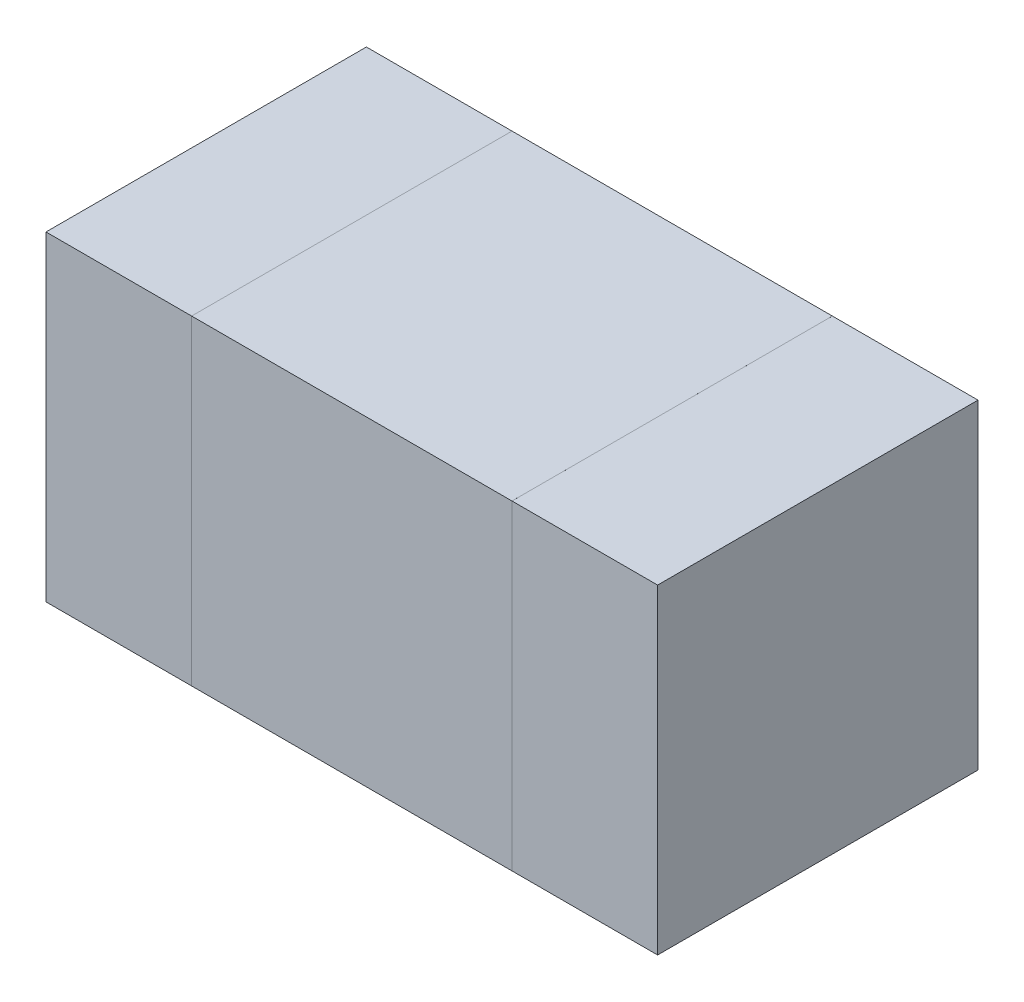
ISO-10303-21;
HEADER;
FILE_DESCRIPTION(('STEP AP214'),'2;1');
FILE_NAME('part.step','',(''),(''),'','','');
FILE_SCHEMA(('AUTOMOTIVE_DESIGN { 1 0 10303 214 1 1 1 1 }'));
ENDSEC;
DATA;
#1=APPLICATION_CONTEXT('core data for automotive mechanical design processes');
#2=APPLICATION_PROTOCOL_DEFINITION('international standard','automotive_design',2000,#1);
#3=PRODUCT_CONTEXT('',#1,'mechanical');
#4=PRODUCT('Part','Part','',(#3));
#5=PRODUCT_RELATED_PRODUCT_CATEGORY('part','',(#4));
#6=PRODUCT_DEFINITION_FORMATION('','',#4);
#7=PRODUCT_DEFINITION_CONTEXT('part definition',#1,'design');
#8=PRODUCT_DEFINITION('design','',#6,#7);
#9=PRODUCT_DEFINITION_SHAPE('','',#8);
#10=(LENGTH_UNIT() NAMED_UNIT(*) SI_UNIT(.MILLI.,.METRE.));
#11=(NAMED_UNIT(*) PLANE_ANGLE_UNIT() SI_UNIT($,.RADIAN.));
#12=(NAMED_UNIT(*) SI_UNIT($,.STERADIAN.) SOLID_ANGLE_UNIT());
#13=UNCERTAINTY_MEASURE_WITH_UNIT(LENGTH_MEASURE(1.E-05),#10,'distance_accuracy_value','');
#14=(GEOMETRIC_REPRESENTATION_CONTEXT(3) GLOBAL_UNCERTAINTY_ASSIGNED_CONTEXT((#13)) GLOBAL_UNIT_ASSIGNED_CONTEXT((#10,
#11,#12)) REPRESENTATION_CONTEXT('',''));
#15=CARTESIAN_POINT('',(0.,0.,0.));
#16=DIRECTION('',(0.,0.,1.));
#17=DIRECTION('',(1.,0.,0.));
#18=AXIS2_PLACEMENT_3D('',#15,#16,#17);
#19=CARTESIAN_POINT('',(3.810002799805,0.285000471953,0.32999934));
#20=DIRECTION('',(0.,0.,-1.));
#21=DIRECTION('',(0.,-1.,0.));
#22=AXIS2_PLACEMENT_3D('',#19,#20,#21);
#23=PLANE('',#22);
#24=DIRECTION('',(0.,1.,0.));
#25=VECTOR('',#24,1.);
#26=CARTESIAN_POINT('',(3.810002799805,0.285000471953,0.32999934));
#27=LINE('',#26,#25);
#28=CARTESIAN_POINT('',(3.810002799805,0.285000471953,0.32999934));
#29=VERTEX_POINT('',#28);
#30=CARTESIAN_POINT('',(3.810002799805,0.615002351953,0.32999934));
#31=VERTEX_POINT('',#30);
#32=EDGE_CURVE('P0_E84',#29,#31,#27,.T.);
#33=ORIENTED_EDGE('',*,*,#32,.T.);
#34=DIRECTION('',(-1.,0.,0.));
#35=VECTOR('',#34,1.);
#36=CARTESIAN_POINT('',(3.810002799805,0.615002351953,0.32999934));
#37=LINE('',#36,#35);
#38=CARTESIAN_POINT('',(3.660000559805,0.615002351953,0.32999934));
#39=VERTEX_POINT('',#38);
#40=EDGE_CURVE('P0_E82',#31,#39,#37,.T.);
#41=ORIENTED_EDGE('',*,*,#40,.T.);
#42=DIRECTION('',(0.,-1.,0.));
#43=VECTOR('',#42,1.);
#44=CARTESIAN_POINT('',(3.660000559805,0.615002351953,0.32999934));
#45=LINE('',#44,#43);
#46=CARTESIAN_POINT('',(3.660000559805,0.285000471953,0.32999934));
#47=VERTEX_POINT('',#46);
#48=EDGE_CURVE('P0_E72',#39,#47,#45,.T.);
#49=ORIENTED_EDGE('',*,*,#48,.T.);
#50=DIRECTION('',(1.,0.,0.));
#51=VECTOR('',#50,1.);
#52=CARTESIAN_POINT('',(3.660000559805,0.285000471953,0.32999934));
#53=LINE('',#52,#51);
#54=EDGE_CURVE('P0_E11',#47,#29,#53,.T.);
#55=ORIENTED_EDGE('',*,*,#54,.T.);
#56=EDGE_LOOP('',(#33,#41,#49,#55));
#57=FACE_BOUND('',#56,.T.);
#58=ADVANCED_FACE('P0_F17',(#57),#23,.F.);
#59=CARTESIAN_POINT('',(3.810002799805,0.285000471953,0.));
#60=DIRECTION('',(0.,0.,-1.));
#61=DIRECTION('',(0.,-1.,0.));
#62=AXIS2_PLACEMENT_3D('',#59,#60,#61);
#63=PLANE('',#62);
#64=DIRECTION('',(1.,0.,0.));
#65=VECTOR('',#64,1.);
#66=CARTESIAN_POINT('',(3.660000559805,0.285000471953,0.));
#67=LINE('',#66,#65);
#68=CARTESIAN_POINT('',(3.660000559805,0.285000471953,0.));
#69=VERTEX_POINT('',#68);
#70=CARTESIAN_POINT('',(3.810002799805,0.285000471953,0.));
#71=VERTEX_POINT('',#70);
#72=EDGE_CURVE('P0_E27',#69,#71,#67,.T.);
#73=ORIENTED_EDGE('',*,*,#72,.F.);
#74=DIRECTION('',(0.,-1.,0.));
#75=VECTOR('',#74,1.);
#76=CARTESIAN_POINT('',(3.660000559805,0.615002351953,0.));
#77=LINE('',#76,#75);
#78=CARTESIAN_POINT('',(3.660000559805,0.615002351953,0.));
#79=VERTEX_POINT('',#78);
#80=EDGE_CURVE('P0_E65',#79,#69,#77,.T.);
#81=ORIENTED_EDGE('',*,*,#80,.F.);
#82=DIRECTION('',(-1.,0.,0.));
#83=VECTOR('',#82,1.);
#84=CARTESIAN_POINT('',(3.810002799805,0.615002351953,0.));
#85=LINE('',#84,#83);
#86=CARTESIAN_POINT('',(3.810002799805,0.615002351953,0.));
#87=VERTEX_POINT('',#86);
#88=EDGE_CURVE('P0_E91',#87,#79,#85,.T.);
#89=ORIENTED_EDGE('',*,*,#88,.F.);
#90=DIRECTION('',(0.,1.,0.));
#91=VECTOR('',#90,1.);
#92=CARTESIAN_POINT('',(3.810002799805,0.285000471953,0.));
#93=LINE('',#92,#91);
#94=EDGE_CURVE('P0_E162',#71,#87,#93,.T.);
#95=ORIENTED_EDGE('',*,*,#94,.F.);
#96=EDGE_LOOP('',(#73,#81,#89,#95));
#97=FACE_BOUND('',#96,.T.);
#98=ADVANCED_FACE('P0_F132',(#97),#63,.T.);
#99=CARTESIAN_POINT('',(3.660000559805,0.285000471953,0.));
#100=DIRECTION('',(0.,1.,0.));
#101=DIRECTION('',(1.,0.,0.));
#102=AXIS2_PLACEMENT_3D('',#99,#100,#101);
#103=PLANE('',#102);
#104=ORIENTED_EDGE('',*,*,#72,.T.);
#105=DIRECTION('',(0.,0.,1.));
#106=VECTOR('',#105,1.);
#107=CARTESIAN_POINT('',(3.810002799805,0.285000471953,0.));
#108=LINE('',#107,#106);
#109=EDGE_CURVE('P0_E96',#71,#29,#108,.T.);
#110=ORIENTED_EDGE('',*,*,#109,.T.);
#111=ORIENTED_EDGE('',*,*,#54,.F.);
#112=DIRECTION('',(0.,0.,1.));
#113=VECTOR('',#112,1.);
#114=CARTESIAN_POINT('',(3.660000559805,0.285000471953,0.));
#115=LINE('',#114,#113);
#116=EDGE_CURVE('P0_E20',#69,#47,#115,.T.);
#117=ORIENTED_EDGE('',*,*,#116,.F.);
#118=EDGE_LOOP('',(#104,#110,#111,#117));
#119=FACE_BOUND('',#118,.T.);
#120=ADVANCED_FACE('P0_F125',(#119),#103,.F.);
#121=CARTESIAN_POINT('',(3.660000559805,0.615002351953,0.));
#122=DIRECTION('',(1.,0.,0.));
#123=DIRECTION('',(0.,1.,0.));
#124=AXIS2_PLACEMENT_3D('',#121,#122,#123);
#125=PLANE('',#124);
#126=ORIENTED_EDGE('',*,*,#80,.T.);
#127=ORIENTED_EDGE('',*,*,#116,.T.);
#128=ORIENTED_EDGE('',*,*,#48,.F.);
#129=DIRECTION('',(0.,0.,1.));
#130=VECTOR('',#129,1.);
#131=CARTESIAN_POINT('',(3.660000559805,0.615002351953,0.));
#132=LINE('',#131,#130);
#133=EDGE_CURVE('P0_E76',#79,#39,#132,.T.);
#134=ORIENTED_EDGE('',*,*,#133,.F.);
#135=EDGE_LOOP('',(#126,#127,#128,#134));
#136=FACE_BOUND('',#135,.T.);
#137=ADVANCED_FACE('P0_F74',(#136),#125,.F.);
#138=CARTESIAN_POINT('',(3.810002799805,0.615002351953,0.));
#139=DIRECTION('',(0.,-1.,0.));
#140=DIRECTION('',(0.,0.,-1.));
#141=AXIS2_PLACEMENT_3D('',#138,#139,#140);
#142=PLANE('',#141);
#143=ORIENTED_EDGE('',*,*,#88,.T.);
#144=ORIENTED_EDGE('',*,*,#133,.T.);
#145=ORIENTED_EDGE('',*,*,#40,.F.);
#146=DIRECTION('',(0.,0.,1.));
#147=VECTOR('',#146,1.);
#148=CARTESIAN_POINT('',(3.810002799805,0.615002351953,0.));
#149=LINE('',#148,#147);
#150=EDGE_CURVE('P0_E171',#87,#31,#149,.T.);
#151=ORIENTED_EDGE('',*,*,#150,.F.);
#152=EDGE_LOOP('',(#143,#144,#145,#151));
#153=FACE_BOUND('',#152,.T.);
#154=ADVANCED_FACE('P0_F90',(#153),#142,.F.);
#155=CARTESIAN_POINT('',(3.810002799805,0.285000471953,0.));
#156=DIRECTION('',(-1.,0.,0.));
#157=DIRECTION('',(0.,0.,1.));
#158=AXIS2_PLACEMENT_3D('',#155,#156,#157);
#159=PLANE('',#158);
#160=ORIENTED_EDGE('',*,*,#94,.T.);
#161=ORIENTED_EDGE('',*,*,#150,.T.);
#162=ORIENTED_EDGE('',*,*,#32,.F.);
#163=ORIENTED_EDGE('',*,*,#109,.F.);
#164=EDGE_LOOP('',(#160,#161,#162,#163));
#165=FACE_BOUND('',#164,.T.);
#166=ADVANCED_FACE('P0_F106',(#165),#159,.F.);
#167=CLOSED_SHELL('',(#58,#98,#120,#137,#154,#166));
#168=MANIFOLD_SOLID_BREP('P0_B1',#167);
#169=CARTESIAN_POINT('',(4.289998527344,0.285000471953,0.32999934));
#170=DIRECTION('',(0.,0.,-1.));
#171=DIRECTION('',(0.,-1.,0.));
#172=AXIS2_PLACEMENT_3D('',#169,#170,#171);
#173=PLANE('',#172);
#174=DIRECTION('',(0.,1.,0.));
#175=VECTOR('',#174,1.);
#176=CARTESIAN_POINT('',(4.289998527344,0.285000471953,0.32999934));
#177=LINE('',#176,#175);
#178=CARTESIAN_POINT('',(4.289998527344,0.285000471953,0.32999934));
#179=VERTEX_POINT('',#178);
#180=CARTESIAN_POINT('',(4.289998527344,0.615002351953,0.32999934));
#181=VERTEX_POINT('',#180);
#182=EDGE_CURVE('P1_E80',#179,#181,#177,.T.);
#183=ORIENTED_EDGE('',*,*,#182,.T.);
#184=DIRECTION('',(-1.,0.,0.));
#185=VECTOR('',#184,1.);
#186=CARTESIAN_POINT('',(4.289998527344,0.615002351953,0.32999934));
#187=LINE('',#186,#185);
#188=CARTESIAN_POINT('',(4.139996287344,0.615002351953,0.32999934));
#189=VERTEX_POINT('',#188);
#190=EDGE_CURVE('P1_E78',#181,#189,#187,.T.);
#191=ORIENTED_EDGE('',*,*,#190,.T.);
#192=DIRECTION('',(0.,-1.,0.));
#193=VECTOR('',#192,1.);
#194=CARTESIAN_POINT('',(4.139996287344,0.615002351953,0.32999934));
#195=LINE('',#194,#193);
#196=CARTESIAN_POINT('',(4.139996287344,0.285000471953,0.32999934));
#197=VERTEX_POINT('',#196);
#198=EDGE_CURVE('P1_E66',#189,#197,#195,.T.);
#199=ORIENTED_EDGE('',*,*,#198,.T.);
#200=DIRECTION('',(1.,0.,0.));
#201=VECTOR('',#200,1.);
#202=CARTESIAN_POINT('',(4.139996287344,0.285000471953,0.32999934));
#203=LINE('',#202,#201);
#204=EDGE_CURVE('P1_E11',#197,#179,#203,.T.);
#205=ORIENTED_EDGE('',*,*,#204,.T.);
#206=EDGE_LOOP('',(#183,#191,#199,#205));
#207=FACE_BOUND('',#206,.T.);
#208=ADVANCED_FACE('P1_F17',(#207),#173,.F.);
#209=CARTESIAN_POINT('',(4.289998527344,0.285000471953,0.));
#210=DIRECTION('',(0.,0.,-1.));
#211=DIRECTION('',(0.,-1.,0.));
#212=AXIS2_PLACEMENT_3D('',#209,#210,#211);
#213=PLANE('',#212);
#214=DIRECTION('',(1.,0.,0.));
#215=VECTOR('',#214,1.);
#216=CARTESIAN_POINT('',(4.139996287344,0.285000471953,0.));
#217=LINE('',#216,#215);
#218=CARTESIAN_POINT('',(4.139996287344,0.285000471953,0.));
#219=VERTEX_POINT('',#218);
#220=CARTESIAN_POINT('',(4.289998527344,0.285000471953,0.));
#221=VERTEX_POINT('',#220);
#222=EDGE_CURVE('P1_E27',#219,#221,#217,.T.);
#223=ORIENTED_EDGE('',*,*,#222,.F.);
#224=DIRECTION('',(0.,-1.,0.));
#225=VECTOR('',#224,1.);
#226=CARTESIAN_POINT('',(4.139996287344,0.615002351953,0.));
#227=LINE('',#226,#225);
#228=CARTESIAN_POINT('',(4.139996287344,0.615002351953,0.));
#229=VERTEX_POINT('',#228);
#230=EDGE_CURVE('P1_E85',#229,#219,#227,.T.);
#231=ORIENTED_EDGE('',*,*,#230,.F.);
#232=DIRECTION('',(-1.,0.,0.));
#233=VECTOR('',#232,1.);
#234=CARTESIAN_POINT('',(4.289998527344,0.615002351953,0.));
#235=LINE('',#234,#233);
#236=CARTESIAN_POINT('',(4.289998527344,0.615002351953,0.));
#237=VERTEX_POINT('',#236);
#238=EDGE_CURVE('P1_E88',#237,#229,#235,.T.);
#239=ORIENTED_EDGE('',*,*,#238,.F.);
#240=DIRECTION('',(0.,1.,0.));
#241=VECTOR('',#240,1.);
#242=CARTESIAN_POINT('',(4.289998527344,0.285000471953,0.));
#243=LINE('',#242,#241);
#244=EDGE_CURVE('P1_E104',#221,#237,#243,.T.);
#245=ORIENTED_EDGE('',*,*,#244,.F.);
#246=EDGE_LOOP('',(#223,#231,#239,#245));
#247=FACE_BOUND('',#246,.T.);
#248=ADVANCED_FACE('P1_F19',(#247),#213,.T.);
#249=CARTESIAN_POINT('',(4.139996287344,0.285000471953,0.));
#250=DIRECTION('',(0.,1.,0.));
#251=DIRECTION('',(1.,0.,0.));
#252=AXIS2_PLACEMENT_3D('',#249,#250,#251);
#253=PLANE('',#252);
#254=ORIENTED_EDGE('',*,*,#222,.T.);
#255=DIRECTION('',(0.,0.,1.));
#256=VECTOR('',#255,1.);
#257=CARTESIAN_POINT('',(4.289998527344,0.285000471953,0.));
#258=LINE('',#257,#256);
#259=EDGE_CURVE('P1_E93',#221,#179,#258,.T.);
#260=ORIENTED_EDGE('',*,*,#259,.T.);
#261=ORIENTED_EDGE('',*,*,#204,.F.);
#262=DIRECTION('',(0.,0.,1.));
#263=VECTOR('',#262,1.);
#264=CARTESIAN_POINT('',(4.139996287344,0.285000471953,0.));
#265=LINE('',#264,#263);
#266=EDGE_CURVE('P1_E73',#219,#197,#265,.T.);
#267=ORIENTED_EDGE('',*,*,#266,.F.);
#268=EDGE_LOOP('',(#254,#260,#261,#267));
#269=FACE_BOUND('',#268,.T.);
#270=ADVANCED_FACE('P1_F98',(#269),#253,.F.);
#271=CARTESIAN_POINT('',(4.139996287344,0.615002351953,0.));
#272=DIRECTION('',(1.,0.,0.));
#273=DIRECTION('',(0.,1.,0.));
#274=AXIS2_PLACEMENT_3D('',#271,#272,#273);
#275=PLANE('',#274);
#276=ORIENTED_EDGE('',*,*,#230,.T.);
#277=ORIENTED_EDGE('',*,*,#266,.T.);
#278=ORIENTED_EDGE('',*,*,#198,.F.);
#279=DIRECTION('',(0.,0.,1.));
#280=VECTOR('',#279,1.);
#281=CARTESIAN_POINT('',(4.139996287344,0.615002351953,0.));
#282=LINE('',#281,#280);
#283=EDGE_CURVE('P1_E71',#229,#189,#282,.T.);
#284=ORIENTED_EDGE('',*,*,#283,.F.);
#285=EDGE_LOOP('',(#276,#277,#278,#284));
#286=FACE_BOUND('',#285,.T.);
#287=ADVANCED_FACE('P1_F69',(#286),#275,.F.);
#288=CARTESIAN_POINT('',(4.289998527344,0.615002351953,0.));
#289=DIRECTION('',(0.,-1.,0.));
#290=DIRECTION('',(0.,0.,-1.));
#291=AXIS2_PLACEMENT_3D('',#288,#289,#290);
#292=PLANE('',#291);
#293=ORIENTED_EDGE('',*,*,#238,.T.);
#294=ORIENTED_EDGE('',*,*,#283,.T.);
#295=ORIENTED_EDGE('',*,*,#190,.F.);
#296=DIRECTION('',(0.,0.,1.));
#297=VECTOR('',#296,1.);
#298=CARTESIAN_POINT('',(4.289998527344,0.615002351953,0.));
#299=LINE('',#298,#297);
#300=EDGE_CURVE('P1_E108',#237,#181,#299,.T.);
#301=ORIENTED_EDGE('',*,*,#300,.F.);
#302=EDGE_LOOP('',(#293,#294,#295,#301));
#303=FACE_BOUND('',#302,.T.);
#304=ADVANCED_FACE('P1_F87',(#303),#292,.F.);
#305=CARTESIAN_POINT('',(4.289998527344,0.285000471953,0.));
#306=DIRECTION('',(-1.,0.,0.));
#307=DIRECTION('',(0.,0.,1.));
#308=AXIS2_PLACEMENT_3D('',#305,#306,#307);
#309=PLANE('',#308);
#310=ORIENTED_EDGE('',*,*,#244,.T.);
#311=ORIENTED_EDGE('',*,*,#300,.T.);
#312=ORIENTED_EDGE('',*,*,#182,.F.);
#313=ORIENTED_EDGE('',*,*,#259,.F.);
#314=EDGE_LOOP('',(#310,#311,#312,#313));
#315=FACE_BOUND('',#314,.T.);
#316=ADVANCED_FACE('P1_F103',(#315),#309,.F.);
#317=CLOSED_SHELL('',(#208,#248,#270,#287,#304,#316));
#318=MANIFOLD_SOLID_BREP('P1_B1',#317);
#319=CARTESIAN_POINT('',(3.80999097418,0.285003011953,0.32999934));
#320=DIRECTION('',(0.,0.,-1.));
#321=DIRECTION('',(0.,-1.,0.));
#322=AXIS2_PLACEMENT_3D('',#319,#320,#321);
#323=PLANE('',#322);
#324=DIRECTION('',(1.,0.,0.));
#325=VECTOR('',#324,1.);
#326=CARTESIAN_POINT('',(3.80999097418,0.285003011953,0.32999934));
#327=LINE('',#326,#325);
#328=CARTESIAN_POINT('',(3.80999097418,0.285003011953,0.32999934));
#329=VERTEX_POINT('',#328);
#330=CARTESIAN_POINT('',(4.13999285418,0.285003011953,0.32999934));
#331=VERTEX_POINT('',#330);
#332=EDGE_CURVE('P2_E82',#329,#331,#327,.T.);
#333=ORIENTED_EDGE('',*,*,#332,.T.);
#334=DIRECTION('',(0.,1.,0.));
#335=VECTOR('',#334,1.);
#336=CARTESIAN_POINT('',(4.13999285418,0.285003011953,0.32999934));
#337=LINE('',#336,#335);
#338=CARTESIAN_POINT('',(4.13999285418,0.615002351953,0.32999934));
#339=VERTEX_POINT('',#338);
#340=EDGE_CURVE('P2_E109',#331,#339,#337,.T.);
#341=ORIENTED_EDGE('',*,*,#340,.T.);
#342=DIRECTION('',(-1.,0.,0.));
#343=VECTOR('',#342,1.);
#344=CARTESIAN_POINT('',(4.13999285418,0.615002351953,0.32999934));
#345=LINE('',#344,#343);
#346=CARTESIAN_POINT('',(3.80999097418,0.615002351953,0.32999934));
#347=VERTEX_POINT('',#346);
#348=EDGE_CURVE('P2_E74',#339,#347,#345,.T.);
#349=ORIENTED_EDGE('',*,*,#348,.T.);
#350=DIRECTION('',(0.,-1.,0.));
#351=VECTOR('',#350,1.);
#352=CARTESIAN_POINT('',(3.80999097418,0.615002351953,0.32999934));
#353=LINE('',#352,#351);
#354=EDGE_CURVE('P2_E11',#347,#329,#353,.T.);
#355=ORIENTED_EDGE('',*,*,#354,.T.);
#356=EDGE_LOOP('',(#333,#341,#349,#355));
#357=FACE_BOUND('',#356,.T.);
#358=ADVANCED_FACE('P2_F17',(#357),#323,.F.);
#359=CARTESIAN_POINT('',(3.80999097418,0.285003011953,0.));
#360=DIRECTION('',(0.,0.,-1.));
#361=DIRECTION('',(0.,-1.,0.));
#362=AXIS2_PLACEMENT_3D('',#359,#360,#361);
#363=PLANE('',#362);
#364=DIRECTION('',(0.,-1.,0.));
#365=VECTOR('',#364,1.);
#366=CARTESIAN_POINT('',(3.80999097418,0.615002351953,0.));
#367=LINE('',#366,#365);
#368=CARTESIAN_POINT('',(3.80999097418,0.615002351953,0.));
#369=VERTEX_POINT('',#368);
#370=CARTESIAN_POINT('',(3.80999097418,0.285003011953,0.));
#371=VERTEX_POINT('',#370);
#372=EDGE_CURVE('P2_E25',#369,#371,#367,.T.);
#373=ORIENTED_EDGE('',*,*,#372,.F.);
#374=DIRECTION('',(-1.,0.,0.));
#375=VECTOR('',#374,1.);
#376=CARTESIAN_POINT('',(4.13999285418,0.615002351953,0.));
#377=LINE('',#376,#375);
#378=CARTESIAN_POINT('',(4.13999285418,0.615002351953,0.));
#379=VERTEX_POINT('',#378);
#380=EDGE_CURVE('P2_E97',#379,#369,#377,.T.);
#381=ORIENTED_EDGE('',*,*,#380,.F.);
#382=DIRECTION('',(0.,1.,0.));
#383=VECTOR('',#382,1.);
#384=CARTESIAN_POINT('',(4.13999285418,0.285003011953,0.));
#385=LINE('',#384,#383);
#386=CARTESIAN_POINT('',(4.13999285418,0.285003011953,0.));
#387=VERTEX_POINT('',#386);
#388=EDGE_CURVE('P2_E84',#387,#379,#385,.T.);
#389=ORIENTED_EDGE('',*,*,#388,.F.);
#390=DIRECTION('',(1.,0.,0.));
#391=VECTOR('',#390,1.);
#392=CARTESIAN_POINT('',(3.80999097418,0.285003011953,0.));
#393=LINE('',#392,#391);
#394=EDGE_CURVE('P2_E80',#371,#387,#393,.T.);
#395=ORIENTED_EDGE('',*,*,#394,.F.);
#396=EDGE_LOOP('',(#373,#381,#389,#395));
#397=FACE_BOUND('',#396,.T.);
#398=ADVANCED_FACE('P2_F86',(#397),#363,.T.);
#399=CARTESIAN_POINT('',(3.80999097418,0.615002351953,0.));
#400=DIRECTION('',(1.,0.,0.));
#401=DIRECTION('',(0.,1.,0.));
#402=AXIS2_PLACEMENT_3D('',#399,#400,#401);
#403=PLANE('',#402);
#404=ORIENTED_EDGE('',*,*,#372,.T.);
#405=DIRECTION('',(0.,0.,1.));
#406=VECTOR('',#405,1.);
#407=CARTESIAN_POINT('',(3.80999097418,0.285003011953,0.));
#408=LINE('',#407,#406);
#409=EDGE_CURVE('P2_E68',#371,#329,#408,.T.);
#410=ORIENTED_EDGE('',*,*,#409,.T.);
#411=ORIENTED_EDGE('',*,*,#354,.F.);
#412=DIRECTION('',(0.,0.,1.));
#413=VECTOR('',#412,1.);
#414=CARTESIAN_POINT('',(3.80999097418,0.615002351953,0.));
#415=LINE('',#414,#413);
#416=EDGE_CURVE('P2_E71',#369,#347,#415,.T.);
#417=ORIENTED_EDGE('',*,*,#416,.F.);
#418=EDGE_LOOP('',(#404,#410,#411,#417));
#419=FACE_BOUND('',#418,.T.);
#420=ADVANCED_FACE('P2_F67',(#419),#403,.F.);
#421=CARTESIAN_POINT('',(4.13999285418,0.615002351953,0.));
#422=DIRECTION('',(0.,-1.,0.));
#423=DIRECTION('',(0.,0.,-1.));
#424=AXIS2_PLACEMENT_3D('',#421,#422,#423);
#425=PLANE('',#424);
#426=ORIENTED_EDGE('',*,*,#380,.T.);
#427=ORIENTED_EDGE('',*,*,#416,.T.);
#428=ORIENTED_EDGE('',*,*,#348,.F.);
#429=DIRECTION('',(0.,0.,1.));
#430=VECTOR('',#429,1.);
#431=CARTESIAN_POINT('',(4.13999285418,0.615002351953,0.));
#432=LINE('',#431,#430);
#433=EDGE_CURVE('P2_E102',#379,#339,#432,.T.);
#434=ORIENTED_EDGE('',*,*,#433,.F.);
#435=EDGE_LOOP('',(#426,#427,#428,#434));
#436=FACE_BOUND('',#435,.T.);
#437=ADVANCED_FACE('P2_F119',(#436),#425,.F.);
#438=CARTESIAN_POINT('',(4.13999285418,0.285003011953,0.));
#439=DIRECTION('',(-1.,0.,0.));
#440=DIRECTION('',(0.,0.,1.));
#441=AXIS2_PLACEMENT_3D('',#438,#439,#440);
#442=PLANE('',#441);
#443=ORIENTED_EDGE('',*,*,#388,.T.);
#444=ORIENTED_EDGE('',*,*,#433,.T.);
#445=ORIENTED_EDGE('',*,*,#340,.F.);
#446=DIRECTION('',(0.,0.,1.));
#447=VECTOR('',#446,1.);
#448=CARTESIAN_POINT('',(4.13999285418,0.285003011953,0.));
#449=LINE('',#448,#447);
#450=EDGE_CURVE('P2_E90',#387,#331,#449,.T.);
#451=ORIENTED_EDGE('',*,*,#450,.F.);
#452=EDGE_LOOP('',(#443,#444,#445,#451));
#453=FACE_BOUND('',#452,.T.);
#454=ADVANCED_FACE('P2_F121',(#453),#442,.F.);
#455=CARTESIAN_POINT('',(3.80999097418,0.285003011953,0.));
#456=DIRECTION('',(0.,1.,0.));
#457=DIRECTION('',(1.,0.,0.));
#458=AXIS2_PLACEMENT_3D('',#455,#456,#457);
#459=PLANE('',#458);
#460=ORIENTED_EDGE('',*,*,#394,.T.);
#461=ORIENTED_EDGE('',*,*,#450,.T.);
#462=ORIENTED_EDGE('',*,*,#332,.F.);
#463=ORIENTED_EDGE('',*,*,#409,.F.);
#464=EDGE_LOOP('',(#460,#461,#462,#463));
#465=FACE_BOUND('',#464,.T.);
#466=ADVANCED_FACE('P2_F78',(#465),#459,.F.);
#467=CLOSED_SHELL('',(#358,#398,#420,#437,#454,#466));
#468=MANIFOLD_SOLID_BREP('P2_B1',#467);
#469=ADVANCED_BREP_SHAPE_REPRESENTATION('',(#18,#168,#318,#468),#14);
#470=SHAPE_DEFINITION_REPRESENTATION(#9,#469);
ENDSEC;
END-ISO-10303-21;
